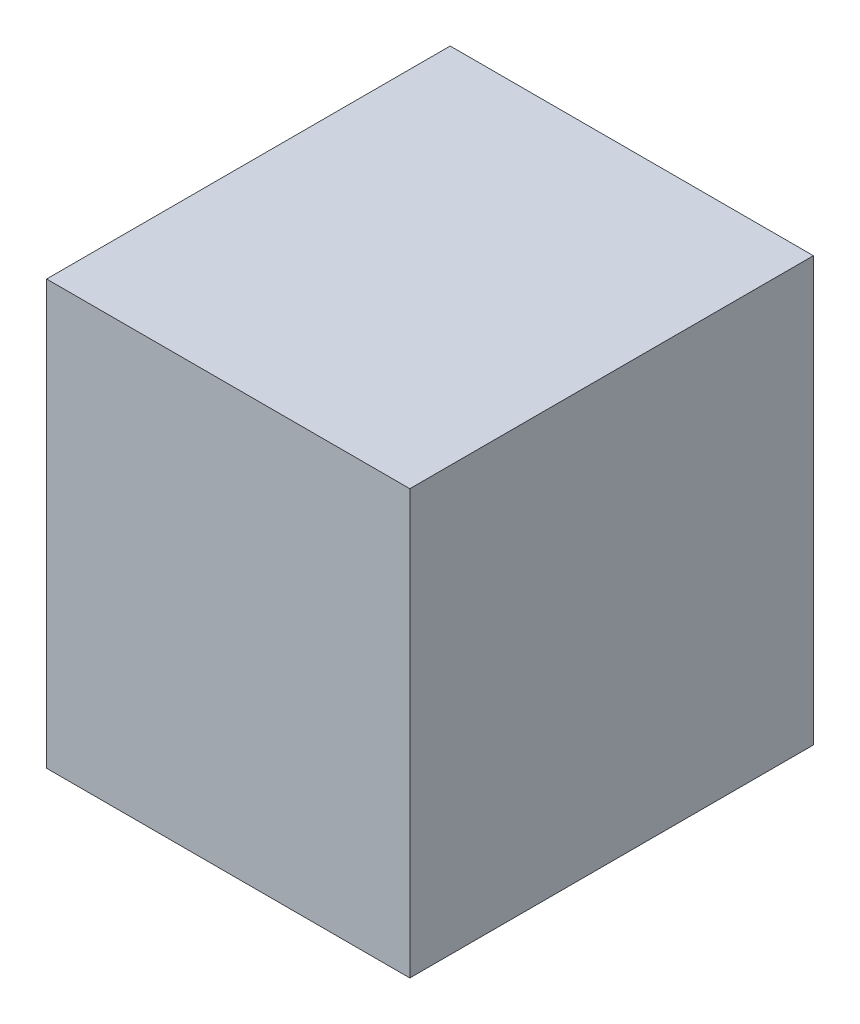
ISO-10303-21;
HEADER;
FILE_DESCRIPTION(('STEP AP214'),'2;1');
FILE_NAME('part.step','',(''),(''),'','','');
FILE_SCHEMA(('AUTOMOTIVE_DESIGN { 1 0 10303 214 1 1 1 1 }'));
ENDSEC;
DATA;
#1=APPLICATION_CONTEXT('core data for automotive mechanical design processes');
#2=APPLICATION_PROTOCOL_DEFINITION('international standard','automotive_design',2000,#1);
#3=PRODUCT_CONTEXT('',#1,'mechanical');
#4=PRODUCT('Part','Part','',(#3));
#5=PRODUCT_RELATED_PRODUCT_CATEGORY('part','',(#4));
#6=PRODUCT_DEFINITION_FORMATION('','',#4);
#7=PRODUCT_DEFINITION_CONTEXT('part definition',#1,'design');
#8=PRODUCT_DEFINITION('design','',#6,#7);
#9=PRODUCT_DEFINITION_SHAPE('','',#8);
#10=(LENGTH_UNIT() NAMED_UNIT(*) SI_UNIT(.MILLI.,.METRE.));
#11=(NAMED_UNIT(*) PLANE_ANGLE_UNIT() SI_UNIT($,.RADIAN.));
#12=(NAMED_UNIT(*) SI_UNIT($,.STERADIAN.) SOLID_ANGLE_UNIT());
#13=UNCERTAINTY_MEASURE_WITH_UNIT(LENGTH_MEASURE(1.E-05),#10,'distance_accuracy_value','');
#14=(GEOMETRIC_REPRESENTATION_CONTEXT(3) GLOBAL_UNCERTAINTY_ASSIGNED_CONTEXT((#13)) GLOBAL_UNIT_ASSIGNED_CONTEXT((#10,
#11,#12)) REPRESENTATION_CONTEXT('',''));
#15=CARTESIAN_POINT('',(0.,0.,0.));
#16=DIRECTION('',(0.,0.,1.));
#17=DIRECTION('',(1.,0.,0.));
#18=AXIS2_PLACEMENT_3D('',#15,#16,#17);
#19=CARTESIAN_POINT('',(-155.448,266.7,-41.148));
#20=DIRECTION('',(1.,0.,0.));
#21=DIRECTION('',(0.,0.,-1.));
#22=AXIS2_PLACEMENT_3D('',#19,#20,#21);
#23=PLANE('',#22);
#24=DIRECTION('',(0.,0.,1.));
#25=VECTOR('',#24,1.);
#26=CARTESIAN_POINT('',(-155.448,0.,-41.148));
#27=LINE('',#26,#25);
#28=CARTESIAN_POINT('',(-155.448,0.,-41.148));
#29=VERTEX_POINT('',#28);
#30=CARTESIAN_POINT('',(-155.448,0.,212.852));
#31=VERTEX_POINT('',#30);
#32=EDGE_CURVE('E109',#29,#31,#27,.T.);
#33=ORIENTED_EDGE('',*,*,#32,.T.);
#34=DIRECTION('',(0.,-1.,0.));
#35=VECTOR('',#34,1.);
#36=CARTESIAN_POINT('',(-155.448,266.7,212.852));
#37=LINE('',#36,#35);
#38=CARTESIAN_POINT('',(-155.448,266.7,212.852));
#39=VERTEX_POINT('',#38);
#40=EDGE_CURVE('E11',#39,#31,#37,.T.);
#41=ORIENTED_EDGE('',*,*,#40,.F.);
#42=DIRECTION('',(0.,0.,1.));
#43=VECTOR('',#42,1.);
#44=CARTESIAN_POINT('',(-155.448,266.7,-41.148));
#45=LINE('',#44,#43);
#46=CARTESIAN_POINT('',(-155.448,266.7,-41.148));
#47=VERTEX_POINT('',#46);
#48=EDGE_CURVE('E93',#47,#39,#45,.T.);
#49=ORIENTED_EDGE('',*,*,#48,.F.);
#50=DIRECTION('',(0.,-1.,0.));
#51=VECTOR('',#50,1.);
#52=CARTESIAN_POINT('',(-155.448,266.7,-41.148));
#53=LINE('',#52,#51);
#54=EDGE_CURVE('E105',#47,#29,#53,.T.);
#55=ORIENTED_EDGE('',*,*,#54,.T.);
#56=EDGE_LOOP('',(#33,#41,#49,#55));
#57=FACE_BOUND('',#56,.T.);
#58=ADVANCED_FACE('F41',(#57),#23,.F.);
#59=CARTESIAN_POINT('',(-155.448,266.7,212.852));
#60=DIRECTION('',(0.,0.,-1.));
#61=DIRECTION('',(-1.,0.,0.));
#62=AXIS2_PLACEMENT_3D('',#59,#60,#61);
#63=PLANE('',#62);
#64=DIRECTION('',(1.,0.,0.));
#65=VECTOR('',#64,1.);
#66=CARTESIAN_POINT('',(-155.448,0.,212.852));
#67=LINE('',#66,#65);
#68=CARTESIAN_POINT('',(73.152,0.,212.852));
#69=VERTEX_POINT('',#68);
#70=EDGE_CURVE('E98',#31,#69,#67,.T.);
#71=ORIENTED_EDGE('',*,*,#70,.T.);
#72=DIRECTION('',(0.,-1.,0.));
#73=VECTOR('',#72,1.);
#74=CARTESIAN_POINT('',(73.152,266.7,212.852));
#75=LINE('',#74,#73);
#76=CARTESIAN_POINT('',(73.152,266.7,212.852));
#77=VERTEX_POINT('',#76);
#78=EDGE_CURVE('E50',#77,#69,#75,.T.);
#79=ORIENTED_EDGE('',*,*,#78,.F.);
#80=DIRECTION('',(1.,0.,0.));
#81=VECTOR('',#80,1.);
#82=CARTESIAN_POINT('',(-155.448,266.7,212.852));
#83=LINE('',#82,#81);
#84=EDGE_CURVE('E88',#39,#77,#83,.T.);
#85=ORIENTED_EDGE('',*,*,#84,.F.);
#86=ORIENTED_EDGE('',*,*,#40,.T.);
#87=EDGE_LOOP('',(#71,#79,#85,#86));
#88=FACE_BOUND('',#87,.T.);
#89=ADVANCED_FACE('F97',(#88),#63,.F.);
#90=CARTESIAN_POINT('',(73.152,266.7,-41.148));
#91=DIRECTION('',(-1.,0.,0.));
#92=DIRECTION('',(0.,0.,1.));
#93=AXIS2_PLACEMENT_3D('',#90,#91,#92);
#94=PLANE('',#93);
#95=DIRECTION('',(0.,0.,-1.));
#96=VECTOR('',#95,1.);
#97=CARTESIAN_POINT('',(73.152,0.,-41.148));
#98=LINE('',#97,#96);
#99=CARTESIAN_POINT('',(73.152,0.,-41.148));
#100=VERTEX_POINT('',#99);
#101=EDGE_CURVE('E75',#69,#100,#98,.T.);
#102=ORIENTED_EDGE('',*,*,#101,.T.);
#103=DIRECTION('',(0.,-1.,0.));
#104=VECTOR('',#103,1.);
#105=CARTESIAN_POINT('',(73.152,266.7,-41.148));
#106=LINE('',#105,#104);
#107=CARTESIAN_POINT('',(73.152,266.7,-41.148));
#108=VERTEX_POINT('',#107);
#109=EDGE_CURVE('E100',#108,#100,#106,.T.);
#110=ORIENTED_EDGE('',*,*,#109,.F.);
#111=DIRECTION('',(0.,0.,-1.));
#112=VECTOR('',#111,1.);
#113=CARTESIAN_POINT('',(73.152,266.7,-41.148));
#114=LINE('',#113,#112);
#115=EDGE_CURVE('E91',#77,#108,#114,.T.);
#116=ORIENTED_EDGE('',*,*,#115,.F.);
#117=ORIENTED_EDGE('',*,*,#78,.T.);
#118=EDGE_LOOP('',(#102,#110,#116,#117));
#119=FACE_BOUND('',#118,.T.);
#120=ADVANCED_FACE('F101',(#119),#94,.F.);
#121=CARTESIAN_POINT('',(-155.448,266.7,-41.148));
#122=DIRECTION('',(0.,0.,1.));
#123=DIRECTION('',(1.,0.,0.));
#124=AXIS2_PLACEMENT_3D('',#121,#122,#123);
#125=PLANE('',#124);
#126=DIRECTION('',(-1.,0.,0.));
#127=VECTOR('',#126,1.);
#128=CARTESIAN_POINT('',(-155.448,0.,-41.148));
#129=LINE('',#128,#127);
#130=EDGE_CURVE('E81',#100,#29,#129,.T.);
#131=ORIENTED_EDGE('',*,*,#130,.T.);
#132=ORIENTED_EDGE('',*,*,#54,.F.);
#133=DIRECTION('',(-1.,0.,0.));
#134=VECTOR('',#133,1.);
#135=CARTESIAN_POINT('',(-155.448,266.7,-41.148));
#136=LINE('',#135,#134);
#137=EDGE_CURVE('E58',#108,#47,#136,.T.);
#138=ORIENTED_EDGE('',*,*,#137,.F.);
#139=ORIENTED_EDGE('',*,*,#109,.T.);
#140=EDGE_LOOP('',(#131,#132,#138,#139));
#141=FACE_BOUND('',#140,.T.);
#142=ADVANCED_FACE('F122',(#141),#125,.F.);
#143=CARTESIAN_POINT('',(0.,266.7,0.));
#144=DIRECTION('',(0.,1.,0.));
#145=DIRECTION('',(0.,0.,1.));
#146=AXIS2_PLACEMENT_3D('',#143,#144,#145);
#147=PLANE('',#146);
#148=ORIENTED_EDGE('',*,*,#48,.T.);
#149=ORIENTED_EDGE('',*,*,#84,.T.);
#150=ORIENTED_EDGE('',*,*,#115,.T.);
#151=ORIENTED_EDGE('',*,*,#137,.T.);
#152=EDGE_LOOP('',(#148,#149,#150,#151));
#153=FACE_BOUND('',#152,.T.);
#154=ADVANCED_FACE('F89',(#153),#147,.T.);
#155=CARTESIAN_POINT('',(0.,0.,0.));
#156=DIRECTION('',(0.,1.,0.));
#157=DIRECTION('',(0.,0.,1.));
#158=AXIS2_PLACEMENT_3D('',#155,#156,#157);
#159=PLANE('',#158);
#160=ORIENTED_EDGE('',*,*,#32,.F.);
#161=ORIENTED_EDGE('',*,*,#130,.F.);
#162=ORIENTED_EDGE('',*,*,#101,.F.);
#163=ORIENTED_EDGE('',*,*,#70,.F.);
#164=EDGE_LOOP('',(#160,#161,#162,#163));
#165=FACE_BOUND('',#164,.T.);
#166=ADVANCED_FACE('F125',(#165),#159,.F.);
#167=CLOSED_SHELL('',(#58,#89,#120,#142,#154,#166));
#168=MANIFOLD_SOLID_BREP('B2',#167);
#169=ADVANCED_BREP_SHAPE_REPRESENTATION('',(#18,#168),#14);
#170=SHAPE_DEFINITION_REPRESENTATION(#9,#169);
ENDSEC;
END-ISO-10303-21;
